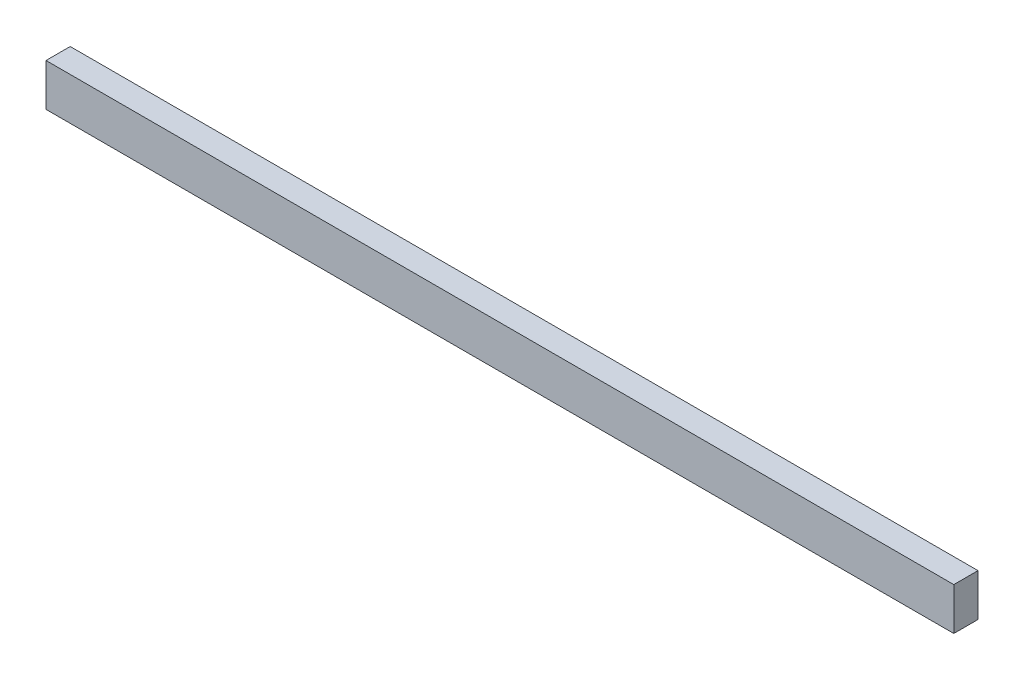
ISO-10303-21;
HEADER;
FILE_DESCRIPTION(('STEP AP214'),'2;1');
FILE_NAME('part.step','',(''),(''),'','','');
FILE_SCHEMA(('AUTOMOTIVE_DESIGN { 1 0 10303 214 1 1 1 1 }'));
ENDSEC;
DATA;
#1=APPLICATION_CONTEXT('core data for automotive mechanical design processes');
#2=APPLICATION_PROTOCOL_DEFINITION('international standard','automotive_design',2000,#1);
#3=PRODUCT_CONTEXT('',#1,'mechanical');
#4=PRODUCT('Part','Part','',(#3));
#5=PRODUCT_RELATED_PRODUCT_CATEGORY('part','',(#4));
#6=PRODUCT_DEFINITION_FORMATION('','',#4);
#7=PRODUCT_DEFINITION_CONTEXT('part definition',#1,'design');
#8=PRODUCT_DEFINITION('design','',#6,#7);
#9=PRODUCT_DEFINITION_SHAPE('','',#8);
#10=(LENGTH_UNIT() NAMED_UNIT(*) SI_UNIT(.MILLI.,.METRE.));
#11=(NAMED_UNIT(*) PLANE_ANGLE_UNIT() SI_UNIT($,.RADIAN.));
#12=(NAMED_UNIT(*) SI_UNIT($,.STERADIAN.) SOLID_ANGLE_UNIT());
#13=UNCERTAINTY_MEASURE_WITH_UNIT(LENGTH_MEASURE(1.E-05),#10,'distance_accuracy_value','');
#14=(GEOMETRIC_REPRESENTATION_CONTEXT(3) GLOBAL_UNCERTAINTY_ASSIGNED_CONTEXT((#13)) GLOBAL_UNIT_ASSIGNED_CONTEXT((#10,
#11,#12)) REPRESENTATION_CONTEXT('',''));
#15=CARTESIAN_POINT('',(0.,0.,0.));
#16=DIRECTION('',(0.,0.,1.));
#17=DIRECTION('',(1.,0.,0.));
#18=AXIS2_PLACEMENT_3D('',#15,#16,#17);
#19=CARTESIAN_POINT('',(750.,35.,40.));
#20=DIRECTION('',(-1.,0.,0.));
#21=DIRECTION('',(0.,0.,1.));
#22=AXIS2_PLACEMENT_3D('',#19,#20,#21);
#23=PLANE('',#22);
#24=DIRECTION('',(0.,1.,0.));
#25=VECTOR('',#24,1.);
#26=CARTESIAN_POINT('',(750.,35.,0.));
#27=LINE('',#26,#25);
#28=CARTESIAN_POINT('',(750.,-35.,0.));
#29=VERTEX_POINT('',#28);
#30=CARTESIAN_POINT('',(750.,35.,0.));
#31=VERTEX_POINT('',#30);
#32=EDGE_CURVE('E97',#29,#31,#27,.T.);
#33=ORIENTED_EDGE('',*,*,#32,.T.);
#34=DIRECTION('',(0.,0.,-1.));
#35=VECTOR('',#34,1.);
#36=CARTESIAN_POINT('',(750.,35.,40.));
#37=LINE('',#36,#35);
#38=CARTESIAN_POINT('',(750.,35.,40.));
#39=VERTEX_POINT('',#38);
#40=EDGE_CURVE('E11',#39,#31,#37,.T.);
#41=ORIENTED_EDGE('',*,*,#40,.F.);
#42=DIRECTION('',(0.,1.,0.));
#43=VECTOR('',#42,1.);
#44=CARTESIAN_POINT('',(750.,35.,40.));
#45=LINE('',#44,#43);
#46=CARTESIAN_POINT('',(750.,-35.,40.));
#47=VERTEX_POINT('',#46);
#48=EDGE_CURVE('E85',#47,#39,#45,.T.);
#49=ORIENTED_EDGE('',*,*,#48,.F.);
#50=DIRECTION('',(0.,0.,-1.));
#51=VECTOR('',#50,1.);
#52=CARTESIAN_POINT('',(750.,-35.,40.));
#53=LINE('',#52,#51);
#54=EDGE_CURVE('E93',#47,#29,#53,.T.);
#55=ORIENTED_EDGE('',*,*,#54,.T.);
#56=EDGE_LOOP('',(#33,#41,#49,#55));
#57=FACE_BOUND('',#56,.T.);
#58=ADVANCED_FACE('F34',(#57),#23,.F.);
#59=CARTESIAN_POINT('',(-750.,35.,40.));
#60=DIRECTION('',(0.,-1.,0.));
#61=DIRECTION('',(0.,0.,-1.));
#62=AXIS2_PLACEMENT_3D('',#59,#60,#61);
#63=PLANE('',#62);
#64=DIRECTION('',(-1.,0.,0.));
#65=VECTOR('',#64,1.);
#66=CARTESIAN_POINT('',(-750.,35.,0.));
#67=LINE('',#66,#65);
#68=CARTESIAN_POINT('',(-750.,35.,0.));
#69=VERTEX_POINT('',#68);
#70=EDGE_CURVE('E89',#31,#69,#67,.T.);
#71=ORIENTED_EDGE('',*,*,#70,.T.);
#72=DIRECTION('',(0.,0.,-1.));
#73=VECTOR('',#72,1.);
#74=CARTESIAN_POINT('',(-750.,35.,40.));
#75=LINE('',#74,#73);
#76=CARTESIAN_POINT('',(-750.,35.,40.));
#77=VERTEX_POINT('',#76);
#78=EDGE_CURVE('E42',#77,#69,#75,.T.);
#79=ORIENTED_EDGE('',*,*,#78,.F.);
#80=DIRECTION('',(-1.,0.,0.));
#81=VECTOR('',#80,1.);
#82=CARTESIAN_POINT('',(-750.,35.,40.));
#83=LINE('',#82,#81);
#84=EDGE_CURVE('E80',#39,#77,#83,.T.);
#85=ORIENTED_EDGE('',*,*,#84,.F.);
#86=ORIENTED_EDGE('',*,*,#40,.T.);
#87=EDGE_LOOP('',(#71,#79,#85,#86));
#88=FACE_BOUND('',#87,.T.);
#89=ADVANCED_FACE('F88',(#88),#63,.F.);
#90=CARTESIAN_POINT('',(-750.,35.,40.));
#91=DIRECTION('',(1.,0.,0.));
#92=DIRECTION('',(0.,0.,-1.));
#93=AXIS2_PLACEMENT_3D('',#90,#91,#92);
#94=PLANE('',#93);
#95=DIRECTION('',(0.,-1.,0.));
#96=VECTOR('',#95,1.);
#97=CARTESIAN_POINT('',(-750.,35.,0.));
#98=LINE('',#97,#96);
#99=CARTESIAN_POINT('',(-750.,-35.,0.));
#100=VERTEX_POINT('',#99);
#101=EDGE_CURVE('E67',#69,#100,#98,.T.);
#102=ORIENTED_EDGE('',*,*,#101,.T.);
#103=DIRECTION('',(0.,0.,-1.));
#104=VECTOR('',#103,1.);
#105=CARTESIAN_POINT('',(-750.,-35.,40.));
#106=LINE('',#105,#104);
#107=CARTESIAN_POINT('',(-750.,-35.,40.));
#108=VERTEX_POINT('',#107);
#109=EDGE_CURVE('E90',#108,#100,#106,.T.);
#110=ORIENTED_EDGE('',*,*,#109,.F.);
#111=DIRECTION('',(0.,-1.,0.));
#112=VECTOR('',#111,1.);
#113=CARTESIAN_POINT('',(-750.,35.,40.));
#114=LINE('',#113,#112);
#115=EDGE_CURVE('E83',#77,#108,#114,.T.);
#116=ORIENTED_EDGE('',*,*,#115,.F.);
#117=ORIENTED_EDGE('',*,*,#78,.T.);
#118=EDGE_LOOP('',(#102,#110,#116,#117));
#119=FACE_BOUND('',#118,.T.);
#120=ADVANCED_FACE('F91',(#119),#94,.F.);
#121=CARTESIAN_POINT('',(-750.,-35.,40.));
#122=DIRECTION('',(0.,1.,0.));
#123=DIRECTION('',(0.,0.,1.));
#124=AXIS2_PLACEMENT_3D('',#121,#122,#123);
#125=PLANE('',#124);
#126=DIRECTION('',(1.,0.,0.));
#127=VECTOR('',#126,1.);
#128=CARTESIAN_POINT('',(-750.,-35.,0.));
#129=LINE('',#128,#127);
#130=EDGE_CURVE('E73',#100,#29,#129,.T.);
#131=ORIENTED_EDGE('',*,*,#130,.T.);
#132=ORIENTED_EDGE('',*,*,#54,.F.);
#133=DIRECTION('',(1.,0.,0.));
#134=VECTOR('',#133,1.);
#135=CARTESIAN_POINT('',(-750.,-35.,40.));
#136=LINE('',#135,#134);
#137=EDGE_CURVE('E50',#108,#47,#136,.T.);
#138=ORIENTED_EDGE('',*,*,#137,.F.);
#139=ORIENTED_EDGE('',*,*,#109,.T.);
#140=EDGE_LOOP('',(#131,#132,#138,#139));
#141=FACE_BOUND('',#140,.T.);
#142=ADVANCED_FACE('F104',(#141),#125,.F.);
#143=CARTESIAN_POINT('',(0.,0.,40.));
#144=DIRECTION('',(0.,0.,1.));
#145=DIRECTION('',(1.,0.,0.));
#146=AXIS2_PLACEMENT_3D('',#143,#144,#145);
#147=PLANE('',#146);
#148=ORIENTED_EDGE('',*,*,#48,.T.);
#149=ORIENTED_EDGE('',*,*,#84,.T.);
#150=ORIENTED_EDGE('',*,*,#115,.T.);
#151=ORIENTED_EDGE('',*,*,#137,.T.);
#152=EDGE_LOOP('',(#148,#149,#150,#151));
#153=FACE_BOUND('',#152,.T.);
#154=ADVANCED_FACE('F81',(#153),#147,.T.);
#155=CARTESIAN_POINT('',(0.,0.,0.));
#156=DIRECTION('',(0.,0.,1.));
#157=DIRECTION('',(1.,0.,0.));
#158=AXIS2_PLACEMENT_3D('',#155,#156,#157);
#159=PLANE('',#158);
#160=ORIENTED_EDGE('',*,*,#32,.F.);
#161=ORIENTED_EDGE('',*,*,#130,.F.);
#162=ORIENTED_EDGE('',*,*,#101,.F.);
#163=ORIENTED_EDGE('',*,*,#70,.F.);
#164=EDGE_LOOP('',(#160,#161,#162,#163));
#165=FACE_BOUND('',#164,.T.);
#166=ADVANCED_FACE('F107',(#165),#159,.F.);
#167=CLOSED_SHELL('',(#58,#89,#120,#142,#154,#166));
#168=MANIFOLD_SOLID_BREP('B2',#167);
#169=ADVANCED_BREP_SHAPE_REPRESENTATION('',(#18,#168),#14);
#170=SHAPE_DEFINITION_REPRESENTATION(#9,#169);
ENDSEC;
END-ISO-10303-21;
